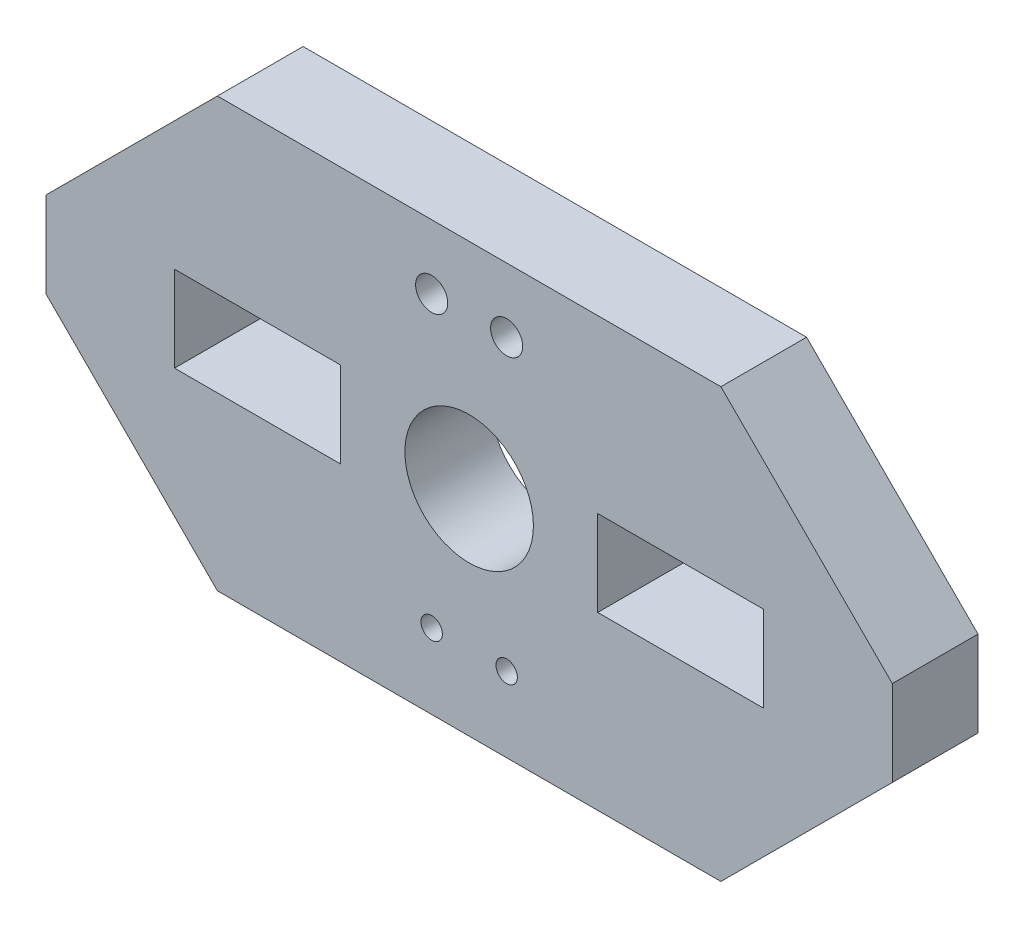
ISO-10303-21;
HEADER;
FILE_DESCRIPTION(('STEP AP214'),'2;1');
FILE_NAME('part.step','',(''),(''),'','','');
FILE_SCHEMA(('AUTOMOTIVE_DESIGN { 1 0 10303 214 1 1 1 1 }'));
ENDSEC;
DATA;
#1=APPLICATION_CONTEXT('core data for automotive mechanical design processes');
#2=APPLICATION_PROTOCOL_DEFINITION('international standard','automotive_design',2000,#1);
#3=PRODUCT_CONTEXT('',#1,'mechanical');
#4=PRODUCT('Part','Part','',(#3));
#5=PRODUCT_RELATED_PRODUCT_CATEGORY('part','',(#4));
#6=PRODUCT_DEFINITION_FORMATION('','',#4);
#7=PRODUCT_DEFINITION_CONTEXT('part definition',#1,'design');
#8=PRODUCT_DEFINITION('design','',#6,#7);
#9=PRODUCT_DEFINITION_SHAPE('','',#8);
#10=(LENGTH_UNIT() NAMED_UNIT(*) SI_UNIT(.MILLI.,.METRE.));
#11=(NAMED_UNIT(*) PLANE_ANGLE_UNIT() SI_UNIT($,.RADIAN.));
#12=(NAMED_UNIT(*) SI_UNIT($,.STERADIAN.) SOLID_ANGLE_UNIT());
#13=UNCERTAINTY_MEASURE_WITH_UNIT(LENGTH_MEASURE(1.E-05),#10,'distance_accuracy_value','');
#14=(GEOMETRIC_REPRESENTATION_CONTEXT(3) GLOBAL_UNCERTAINTY_ASSIGNED_CONTEXT((#13)) GLOBAL_UNIT_ASSIGNED_CONTEXT((#10,
#11,#12)) REPRESENTATION_CONTEXT('',''));
#15=CARTESIAN_POINT('',(0.,0.,0.));
#16=DIRECTION('',(0.,0.,1.));
#17=DIRECTION('',(1.,0.,0.));
#18=AXIS2_PLACEMENT_3D('',#15,#16,#17);
#19=CARTESIAN_POINT('',(-1.99999693325685,9.99999803628087,4.));
#20=DIRECTION('',(0.,0.,-1.));
#21=DIRECTION('',(-1.,0.,0.));
#22=AXIS2_PLACEMENT_3D('',#19,#20,#21);
#23=PLANE('',#22);
#24=CARTESIAN_POINT('',(18.0000030667433,3.49999803628092,4.));
#25=DIRECTION('',(0.,0.,1.));
#26=DIRECTION('',(1.,0.,0.));
#27=AXIS2_PLACEMENT_3D('',#24,#25,#26);
#28=CIRCLE('',#27,0.5);
#29=CARTESIAN_POINT('',(18.5000030667433,3.49999803628092,4.));
#30=VERTEX_POINT('',#29);
#31=EDGE_CURVE('E369',#30,#30,#28,.T.);
#32=ORIENTED_EDGE('',*,*,#31,.F.);
#33=EDGE_LOOP('',(#32));
#34=FACE_BOUND('',#33,.T.);
#35=CARTESIAN_POINT('',(18.0000030667433,16.9999980362809,4.));
#36=DIRECTION('',(0.,0.,1.));
#37=DIRECTION('',(1.,0.,0.));
#38=AXIS2_PLACEMENT_3D('',#35,#36,#37);
#39=CIRCLE('',#38,0.750000000000001);
#40=CARTESIAN_POINT('',(18.7500030667433,16.9999980362809,4.));
#41=VERTEX_POINT('',#40);
#42=EDGE_CURVE('E381',#41,#41,#39,.T.);
#43=ORIENTED_EDGE('',*,*,#42,.F.);
#44=EDGE_LOOP('',(#43));
#45=FACE_BOUND('',#44,.T.);
#46=DIRECTION('',(1.,0.,0.));
#47=VECTOR('',#46,1.);
#48=CARTESIAN_POINT('',(33.5000030667432,7.99999803628092,4.));
#49=LINE('',#48,#47);
#50=CARTESIAN_POINT('',(25.7500030667433,7.99999803628092,4.));
#51=VERTEX_POINT('',#50);
#52=CARTESIAN_POINT('',(33.5000030667432,7.99999803628092,4.));
#53=VERTEX_POINT('',#52);
#54=EDGE_CURVE('E145',#51,#53,#49,.T.);
#55=ORIENTED_EDGE('',*,*,#54,.F.);
#56=DIRECTION('',(0.,-1.,0.));
#57=VECTOR('',#56,1.);
#58=CARTESIAN_POINT('',(25.7500030667433,7.99999803628092,4.));
#59=LINE('',#58,#57);
#60=CARTESIAN_POINT('',(25.7500030667433,11.9999980362809,4.));
#61=VERTEX_POINT('',#60);
#62=EDGE_CURVE('E168',#61,#51,#59,.T.);
#63=ORIENTED_EDGE('',*,*,#62,.F.);
#64=DIRECTION('',(-1.,0.,0.));
#65=VECTOR('',#64,1.);
#66=CARTESIAN_POINT('',(25.7500030667433,11.9999980362809,4.));
#67=LINE('',#66,#65);
#68=CARTESIAN_POINT('',(33.5000030667432,11.9999980362809,4.));
#69=VERTEX_POINT('',#68);
#70=EDGE_CURVE('E166',#69,#61,#67,.T.);
#71=ORIENTED_EDGE('',*,*,#70,.F.);
#72=DIRECTION('',(0.,1.,0.));
#73=VECTOR('',#72,1.);
#74=CARTESIAN_POINT('',(33.5000030667432,11.9999980362809,4.));
#75=LINE('',#74,#73);
#76=EDGE_CURVE('E153',#53,#69,#75,.T.);
#77=ORIENTED_EDGE('',*,*,#76,.F.);
#78=EDGE_LOOP('',(#55,#63,#71,#77));
#79=FACE_BOUND('',#78,.T.);
#80=DIRECTION('',(-0.707106781186549,-0.707106781186546,0.));
#81=VECTOR('',#80,1.);
#82=CARTESIAN_POINT('',(8.00000306674323,19.9999980362809,4.));
#83=LINE('',#82,#81);
#84=CARTESIAN_POINT('',(8.00000306674323,19.9999980362809,4.));
#85=VERTEX_POINT('',#84);
#86=CARTESIAN_POINT('',(3.0667431972E-06,11.9999980362809,4.));
#87=VERTEX_POINT('',#86);
#88=EDGE_CURVE('E215',#85,#87,#83,.T.);
#89=ORIENTED_EDGE('',*,*,#88,.T.);
#90=DIRECTION('',(0.,-1.,0.));
#91=VECTOR('',#90,1.);
#92=CARTESIAN_POINT('',(3.066743254E-06,7.99999803628081,4.));
#93=LINE('',#92,#91);
#94=CARTESIAN_POINT('',(3.066743254E-06,7.99999803628081,4.));
#95=VERTEX_POINT('',#94);
#96=EDGE_CURVE('E218',#87,#95,#93,.T.);
#97=ORIENTED_EDGE('',*,*,#96,.T.);
#98=DIRECTION('',(0.707106781186556,-0.707106781186539,0.));
#99=VECTOR('',#98,1.);
#100=CARTESIAN_POINT('',(8.00000306674333,-1.9637190771E-06,4.));
#101=LINE('',#100,#99);
#102=CARTESIAN_POINT('',(8.00000306674333,-1.9637190771E-06,4.));
#103=VERTEX_POINT('',#102);
#104=EDGE_CURVE('E221',#95,#103,#101,.T.);
#105=ORIENTED_EDGE('',*,*,#104,.T.);
#106=DIRECTION('',(1.,0.,0.));
#107=VECTOR('',#106,1.);
#108=CARTESIAN_POINT('',(31.5000030667432,-1.963719078E-06,4.));
#109=LINE('',#108,#107);
#110=CARTESIAN_POINT('',(31.5000030667432,-1.963719078E-06,4.));
#111=VERTEX_POINT('',#110);
#112=EDGE_CURVE('E223',#103,#111,#109,.T.);
#113=ORIENTED_EDGE('',*,*,#112,.T.);
#114=DIRECTION('',(0.707106781186548,0.707106781186547,0.));
#115=VECTOR('',#114,1.);
#116=CARTESIAN_POINT('',(31.5000030667432,-1.963719078E-06,4.));
#117=LINE('',#116,#115);
#118=CARTESIAN_POINT('',(39.5000030667432,7.99999803628092,4.));
#119=VERTEX_POINT('',#118);
#120=EDGE_CURVE('E225',#111,#119,#117,.T.);
#121=ORIENTED_EDGE('',*,*,#120,.T.);
#122=DIRECTION('',(0.,1.,0.));
#123=VECTOR('',#122,1.);
#124=CARTESIAN_POINT('',(39.5000030667432,11.9999980362809,4.));
#125=LINE('',#124,#123);
#126=CARTESIAN_POINT('',(39.5000030667432,11.9999980362809,4.));
#127=VERTEX_POINT('',#126);
#128=EDGE_CURVE('E227',#119,#127,#125,.T.);
#129=ORIENTED_EDGE('',*,*,#128,.T.);
#130=DIRECTION('',(-0.707106781186548,0.707106781186547,0.));
#131=VECTOR('',#130,1.);
#132=CARTESIAN_POINT('',(39.5000030667432,11.9999980362809,4.));
#133=LINE('',#132,#131);
#134=CARTESIAN_POINT('',(31.5000030667432,19.9999980362809,4.));
#135=VERTEX_POINT('',#134);
#136=EDGE_CURVE('E229',#127,#135,#133,.T.);
#137=ORIENTED_EDGE('',*,*,#136,.T.);
#138=DIRECTION('',(-1.,0.,0.));
#139=VECTOR('',#138,1.);
#140=CARTESIAN_POINT('',(8.00000306674323,19.9999980362809,4.));
#141=LINE('',#140,#139);
#142=EDGE_CURVE('E231',#135,#85,#141,.T.);
#143=ORIENTED_EDGE('',*,*,#142,.T.);
#144=EDGE_LOOP('',(#89,#97,#105,#113,#121,#129,#137,#143));
#145=FACE_BOUND('',#144,.T.);
#146=DIRECTION('',(1.,0.,0.));
#147=VECTOR('',#146,1.);
#148=CARTESIAN_POINT('',(13.7500030667433,7.99999803628092,4.));
#149=LINE('',#148,#147);
#150=CARTESIAN_POINT('',(6.00000306674333,7.99999803628092,4.));
#151=VERTEX_POINT('',#150);
#152=CARTESIAN_POINT('',(13.7500030667433,7.99999803628092,4.));
#153=VERTEX_POINT('',#152);
#154=EDGE_CURVE('E184',#151,#153,#149,.T.);
#155=ORIENTED_EDGE('',*,*,#154,.F.);
#156=DIRECTION('',(0.,-1.,0.));
#157=VECTOR('',#156,1.);
#158=CARTESIAN_POINT('',(6.00000306674333,7.99999803628092,4.));
#159=LINE('',#158,#157);
#160=CARTESIAN_POINT('',(6.00000306674333,11.9999980362809,4.));
#161=VERTEX_POINT('',#160);
#162=EDGE_CURVE('E192',#161,#151,#159,.T.);
#163=ORIENTED_EDGE('',*,*,#162,.F.);
#164=DIRECTION('',(-1.,0.,0.));
#165=VECTOR('',#164,1.);
#166=CARTESIAN_POINT('',(6.00000306674333,11.9999980362809,4.));
#167=LINE('',#166,#165);
#168=CARTESIAN_POINT('',(13.7500030667433,11.9999980362809,4.));
#169=VERTEX_POINT('',#168);
#170=EDGE_CURVE('E189',#169,#161,#167,.T.);
#171=ORIENTED_EDGE('',*,*,#170,.F.);
#172=DIRECTION('',(0.,1.,0.));
#173=VECTOR('',#172,1.);
#174=CARTESIAN_POINT('',(13.7500030667433,11.9999980362809,4.));
#175=LINE('',#174,#173);
#176=EDGE_CURVE('E186',#153,#169,#175,.T.);
#177=ORIENTED_EDGE('',*,*,#176,.F.);
#178=EDGE_LOOP('',(#155,#163,#171,#177));
#179=FACE_BOUND('',#178,.T.);
#180=CARTESIAN_POINT('',(19.7500030667433,9.99999803628092,4.));
#181=DIRECTION('',(0.,0.,1.));
#182=DIRECTION('',(1.,0.,0.));
#183=AXIS2_PLACEMENT_3D('',#180,#181,#182);
#184=CIRCLE('',#183,3.);
#185=CARTESIAN_POINT('',(22.7500030667433,9.99999803628092,4.));
#186=VERTEX_POINT('',#185);
#187=EDGE_CURVE('E174',#186,#186,#184,.T.);
#188=ORIENTED_EDGE('',*,*,#187,.F.);
#189=EDGE_LOOP('',(#188));
#190=FACE_BOUND('',#189,.T.);
#191=CARTESIAN_POINT('',(21.5000030667433,16.9999980362809,4.));
#192=DIRECTION('',(0.,0.,1.));
#193=DIRECTION('',(1.,0.,0.));
#194=AXIS2_PLACEMENT_3D('',#191,#192,#193);
#195=CIRCLE('',#194,0.750000000000001);
#196=CARTESIAN_POINT('',(22.2500030667433,16.9999980362809,4.));
#197=VERTEX_POINT('',#196);
#198=EDGE_CURVE('E360',#197,#197,#195,.T.);
#199=ORIENTED_EDGE('',*,*,#198,.F.);
#200=EDGE_LOOP('',(#199));
#201=FACE_BOUND('',#200,.T.);
#202=CARTESIAN_POINT('',(21.5000030667433,3.49999803628092,4.));
#203=DIRECTION('',(0.,0.,1.));
#204=DIRECTION('',(1.,0.,0.));
#205=AXIS2_PLACEMENT_3D('',#202,#203,#204);
#206=CIRCLE('',#205,0.5);
#207=CARTESIAN_POINT('',(22.0000030667433,3.49999803628092,4.));
#208=VERTEX_POINT('',#207);
#209=EDGE_CURVE('E363',#208,#208,#206,.T.);
#210=ORIENTED_EDGE('',*,*,#209,.F.);
#211=EDGE_LOOP('',(#210));
#212=FACE_BOUND('',#211,.T.);
#213=ADVANCED_FACE('F32',(#34,#45,#79,#145,#179,#190,#201,#212),#23,.F.);
#214=CARTESIAN_POINT('',(-1.99999693325685,9.99999803628087,0.));
#215=DIRECTION('',(0.,0.,-1.));
#216=DIRECTION('',(-1.,0.,0.));
#217=AXIS2_PLACEMENT_3D('',#214,#215,#216);
#218=PLANE('',#217);
#219=CARTESIAN_POINT('',(18.0000030667433,3.49999803628092,0.));
#220=DIRECTION('',(0.,0.,1.));
#221=DIRECTION('',(1.,0.,0.));
#222=AXIS2_PLACEMENT_3D('',#219,#220,#221);
#223=CIRCLE('',#222,0.5);
#224=CARTESIAN_POINT('',(18.5000030667433,3.49999803628092,0.));
#225=VERTEX_POINT('',#224);
#226=EDGE_CURVE('E365',#225,#225,#223,.T.);
#227=ORIENTED_EDGE('',*,*,#226,.T.);
#228=EDGE_LOOP('',(#227));
#229=FACE_BOUND('',#228,.T.);
#230=CARTESIAN_POINT('',(18.0000030667433,16.9999980362809,0.));
#231=DIRECTION('',(0.,0.,1.));
#232=DIRECTION('',(1.,0.,0.));
#233=AXIS2_PLACEMENT_3D('',#230,#231,#232);
#234=CIRCLE('',#233,0.750000000000001);
#235=CARTESIAN_POINT('',(18.7500030667433,16.9999980362809,0.));
#236=VERTEX_POINT('',#235);
#237=EDGE_CURVE('E378',#236,#236,#234,.T.);
#238=ORIENTED_EDGE('',*,*,#237,.T.);
#239=EDGE_LOOP('',(#238));
#240=FACE_BOUND('',#239,.T.);
#241=DIRECTION('',(0.,-1.,0.));
#242=VECTOR('',#241,1.);
#243=CARTESIAN_POINT('',(25.7500030667433,7.99999803628092,0.));
#244=LINE('',#243,#242);
#245=CARTESIAN_POINT('',(25.7500030667433,11.9999980362809,0.));
#246=VERTEX_POINT('',#245);
#247=CARTESIAN_POINT('',(25.7500030667433,7.99999803628092,0.));
#248=VERTEX_POINT('',#247);
#249=EDGE_CURVE('E154',#246,#248,#244,.T.);
#250=ORIENTED_EDGE('',*,*,#249,.T.);
#251=DIRECTION('',(1.,0.,0.));
#252=VECTOR('',#251,1.);
#253=CARTESIAN_POINT('',(33.5000030667432,7.99999803628092,0.));
#254=LINE('',#253,#252);
#255=CARTESIAN_POINT('',(33.5000030667432,7.99999803628092,0.));
#256=VERTEX_POINT('',#255);
#257=EDGE_CURVE('E55',#248,#256,#254,.T.);
#258=ORIENTED_EDGE('',*,*,#257,.T.);
#259=DIRECTION('',(0.,1.,0.));
#260=VECTOR('',#259,1.);
#261=CARTESIAN_POINT('',(33.5000030667432,11.9999980362809,0.));
#262=LINE('',#261,#260);
#263=CARTESIAN_POINT('',(33.5000030667432,11.9999980362809,0.));
#264=VERTEX_POINT('',#263);
#265=EDGE_CURVE('E160',#256,#264,#262,.T.);
#266=ORIENTED_EDGE('',*,*,#265,.T.);
#267=DIRECTION('',(-1.,0.,0.));
#268=VECTOR('',#267,1.);
#269=CARTESIAN_POINT('',(25.7500030667433,11.9999980362809,0.));
#270=LINE('',#269,#268);
#271=EDGE_CURVE('E176',#264,#246,#270,.T.);
#272=ORIENTED_EDGE('',*,*,#271,.T.);
#273=EDGE_LOOP('',(#250,#258,#266,#272));
#274=FACE_BOUND('',#273,.T.);
#275=DIRECTION('',(-0.707106781186549,-0.707106781186546,0.));
#276=VECTOR('',#275,1.);
#277=CARTESIAN_POINT('',(8.00000306674323,19.9999980362809,0.));
#278=LINE('',#277,#276);
#279=CARTESIAN_POINT('',(8.00000306674323,19.9999980362809,0.));
#280=VERTEX_POINT('',#279);
#281=CARTESIAN_POINT('',(3.0667431972E-06,11.9999980362809,0.));
#282=VERTEX_POINT('',#281);
#283=EDGE_CURVE('E214',#280,#282,#278,.T.);
#284=ORIENTED_EDGE('',*,*,#283,.F.);
#285=DIRECTION('',(-1.,0.,0.));
#286=VECTOR('',#285,1.);
#287=CARTESIAN_POINT('',(8.00000306674323,19.9999980362809,0.));
#288=LINE('',#287,#286);
#289=CARTESIAN_POINT('',(31.5000030667432,19.9999980362809,0.));
#290=VERTEX_POINT('',#289);
#291=EDGE_CURVE('E219',#290,#280,#288,.T.);
#292=ORIENTED_EDGE('',*,*,#291,.F.);
#293=DIRECTION('',(-0.707106781186548,0.707106781186547,0.));
#294=VECTOR('',#293,1.);
#295=CARTESIAN_POINT('',(39.5000030667432,11.9999980362809,0.));
#296=LINE('',#295,#294);
#297=CARTESIAN_POINT('',(39.5000030667432,11.9999980362809,0.));
#298=VERTEX_POINT('',#297);
#299=EDGE_CURVE('E246',#298,#290,#296,.T.);
#300=ORIENTED_EDGE('',*,*,#299,.F.);
#301=DIRECTION('',(0.,1.,0.));
#302=VECTOR('',#301,1.);
#303=CARTESIAN_POINT('',(39.5000030667432,11.9999980362809,0.));
#304=LINE('',#303,#302);
#305=CARTESIAN_POINT('',(39.5000030667432,7.99999803628092,0.));
#306=VERTEX_POINT('',#305);
#307=EDGE_CURVE('E244',#306,#298,#304,.T.);
#308=ORIENTED_EDGE('',*,*,#307,.F.);
#309=DIRECTION('',(0.707106781186548,0.707106781186547,0.));
#310=VECTOR('',#309,1.);
#311=CARTESIAN_POINT('',(31.5000030667432,-1.963719078E-06,0.));
#312=LINE('',#311,#310);
#313=CARTESIAN_POINT('',(31.5000030667432,-1.963719078E-06,0.));
#314=VERTEX_POINT('',#313);
#315=EDGE_CURVE('E242',#314,#306,#312,.T.);
#316=ORIENTED_EDGE('',*,*,#315,.F.);
#317=DIRECTION('',(1.,0.,0.));
#318=VECTOR('',#317,1.);
#319=CARTESIAN_POINT('',(31.5000030667432,-1.963719078E-06,0.));
#320=LINE('',#319,#318);
#321=CARTESIAN_POINT('',(8.00000306674333,-1.9637190771E-06,0.));
#322=VERTEX_POINT('',#321);
#323=EDGE_CURVE('E240',#322,#314,#320,.T.);
#324=ORIENTED_EDGE('',*,*,#323,.F.);
#325=DIRECTION('',(0.707106781186556,-0.707106781186539,0.));
#326=VECTOR('',#325,1.);
#327=CARTESIAN_POINT('',(8.00000306674333,-1.9637190771E-06,0.));
#328=LINE('',#327,#326);
#329=CARTESIAN_POINT('',(3.066743254E-06,7.99999803628081,0.));
#330=VERTEX_POINT('',#329);
#331=EDGE_CURVE('E238',#330,#322,#328,.T.);
#332=ORIENTED_EDGE('',*,*,#331,.F.);
#333=DIRECTION('',(0.,-1.,0.));
#334=VECTOR('',#333,1.);
#335=CARTESIAN_POINT('',(3.066743254E-06,7.99999803628081,0.));
#336=LINE('',#335,#334);
#337=EDGE_CURVE('E236',#282,#330,#336,.T.);
#338=ORIENTED_EDGE('',*,*,#337,.F.);
#339=EDGE_LOOP('',(#284,#292,#300,#308,#316,#324,#332,#338));
#340=FACE_BOUND('',#339,.T.);
#341=DIRECTION('',(0.,-1.,0.));
#342=VECTOR('',#341,1.);
#343=CARTESIAN_POINT('',(6.00000306674333,7.99999803628092,0.));
#344=LINE('',#343,#342);
#345=CARTESIAN_POINT('',(6.00000306674333,11.9999980362809,0.));
#346=VERTEX_POINT('',#345);
#347=CARTESIAN_POINT('',(6.00000306674333,7.99999803628092,0.));
#348=VERTEX_POINT('',#347);
#349=EDGE_CURVE('E187',#346,#348,#344,.T.);
#350=ORIENTED_EDGE('',*,*,#349,.T.);
#351=DIRECTION('',(1.,0.,0.));
#352=VECTOR('',#351,1.);
#353=CARTESIAN_POINT('',(13.7500030667433,7.99999803628092,0.));
#354=LINE('',#353,#352);
#355=CARTESIAN_POINT('',(13.7500030667433,7.99999803628092,0.));
#356=VERTEX_POINT('',#355);
#357=EDGE_CURVE('E161',#348,#356,#354,.T.);
#358=ORIENTED_EDGE('',*,*,#357,.T.);
#359=DIRECTION('',(0.,1.,0.));
#360=VECTOR('',#359,1.);
#361=CARTESIAN_POINT('',(13.7500030667433,11.9999980362809,0.));
#362=LINE('',#361,#360);
#363=CARTESIAN_POINT('',(13.7500030667433,11.9999980362809,0.));
#364=VERTEX_POINT('',#363);
#365=EDGE_CURVE('E197',#356,#364,#362,.T.);
#366=ORIENTED_EDGE('',*,*,#365,.T.);
#367=DIRECTION('',(-1.,0.,0.));
#368=VECTOR('',#367,1.);
#369=CARTESIAN_POINT('',(6.00000306674333,11.9999980362809,0.));
#370=LINE('',#369,#368);
#371=EDGE_CURVE('E200',#364,#346,#370,.T.);
#372=ORIENTED_EDGE('',*,*,#371,.T.);
#373=EDGE_LOOP('',(#350,#358,#366,#372));
#374=FACE_BOUND('',#373,.T.);
#375=CARTESIAN_POINT('',(19.7500030667433,9.99999803628092,0.));
#376=DIRECTION('',(0.,0.,1.));
#377=DIRECTION('',(1.,0.,0.));
#378=AXIS2_PLACEMENT_3D('',#375,#376,#377);
#379=CIRCLE('',#378,3.);
#380=CARTESIAN_POINT('',(22.7500030667433,9.99999803628092,0.));
#381=VERTEX_POINT('',#380);
#382=EDGE_CURVE('E384',#381,#381,#379,.T.);
#383=ORIENTED_EDGE('',*,*,#382,.T.);
#384=EDGE_LOOP('',(#383));
#385=FACE_BOUND('',#384,.T.);
#386=CARTESIAN_POINT('',(21.5000030667433,16.9999980362809,0.));
#387=DIRECTION('',(0.,0.,1.));
#388=DIRECTION('',(1.,0.,0.));
#389=AXIS2_PLACEMENT_3D('',#386,#387,#388);
#390=CIRCLE('',#389,0.750000000000001);
#391=CARTESIAN_POINT('',(22.2500030667433,16.9999980362809,0.));
#392=VERTEX_POINT('',#391);
#393=EDGE_CURVE('E375',#392,#392,#390,.T.);
#394=ORIENTED_EDGE('',*,*,#393,.T.);
#395=EDGE_LOOP('',(#394));
#396=FACE_BOUND('',#395,.T.);
#397=CARTESIAN_POINT('',(21.5000030667433,3.49999803628092,0.));
#398=DIRECTION('',(0.,0.,1.));
#399=DIRECTION('',(1.,0.,0.));
#400=AXIS2_PLACEMENT_3D('',#397,#398,#399);
#401=CIRCLE('',#400,0.5);
#402=CARTESIAN_POINT('',(22.0000030667433,3.49999803628092,0.));
#403=VERTEX_POINT('',#402);
#404=EDGE_CURVE('E366',#403,#403,#401,.T.);
#405=ORIENTED_EDGE('',*,*,#404,.T.);
#406=EDGE_LOOP('',(#405));
#407=FACE_BOUND('',#406,.T.);
#408=ADVANCED_FACE('F276',(#229,#240,#274,#340,#374,#385,#396,#407),#218,.T.);
#409=CARTESIAN_POINT('',(8.00000306674323,19.9999980362809,4.));
#410=DIRECTION('',(0.707106781186546,-0.707106781186549,0.));
#411=DIRECTION('',(0.707106781186549,0.707106781186546,0.));
#412=AXIS2_PLACEMENT_3D('',#409,#410,#411);
#413=PLANE('',#412);
#414=ORIENTED_EDGE('',*,*,#283,.T.);
#415=DIRECTION('',(0.,0.,-1.));
#416=VECTOR('',#415,1.);
#417=CARTESIAN_POINT('',(3.0667431972E-06,11.9999980362809,4.));
#418=LINE('',#417,#416);
#419=EDGE_CURVE('E11',#87,#282,#418,.T.);
#420=ORIENTED_EDGE('',*,*,#419,.F.);
#421=ORIENTED_EDGE('',*,*,#88,.F.);
#422=DIRECTION('',(0.,0.,-1.));
#423=VECTOR('',#422,1.);
#424=CARTESIAN_POINT('',(8.00000306674323,19.9999980362809,4.));
#425=LINE('',#424,#423);
#426=EDGE_CURVE('E233',#85,#280,#425,.T.);
#427=ORIENTED_EDGE('',*,*,#426,.T.);
#428=EDGE_LOOP('',(#414,#420,#421,#427));
#429=FACE_BOUND('',#428,.T.);
#430=ADVANCED_FACE('F34',(#429),#413,.F.);
#431=CARTESIAN_POINT('',(3.066743254E-06,7.99999803628081,4.));
#432=DIRECTION('',(1.,0.,0.));
#433=DIRECTION('',(0.,1.,0.));
#434=AXIS2_PLACEMENT_3D('',#431,#432,#433);
#435=PLANE('',#434);
#436=ORIENTED_EDGE('',*,*,#337,.T.);
#437=DIRECTION('',(0.,0.,-1.));
#438=VECTOR('',#437,1.);
#439=CARTESIAN_POINT('',(3.066743254E-06,7.99999803628081,4.));
#440=LINE('',#439,#438);
#441=EDGE_CURVE('E40',#95,#330,#440,.T.);
#442=ORIENTED_EDGE('',*,*,#441,.F.);
#443=ORIENTED_EDGE('',*,*,#96,.F.);
#444=ORIENTED_EDGE('',*,*,#419,.T.);
#445=EDGE_LOOP('',(#436,#442,#443,#444));
#446=FACE_BOUND('',#445,.T.);
#447=ADVANCED_FACE('F293',(#446),#435,.F.);
#448=CARTESIAN_POINT('',(8.00000306674333,-1.9637190771E-06,4.));
#449=DIRECTION('',(0.707106781186539,0.707106781186556,0.));
#450=DIRECTION('',(-0.707106781186556,0.707106781186539,0.));
#451=AXIS2_PLACEMENT_3D('',#448,#449,#450);
#452=PLANE('',#451);
#453=ORIENTED_EDGE('',*,*,#331,.T.);
#454=DIRECTION('',(0.,0.,-1.));
#455=VECTOR('',#454,1.);
#456=CARTESIAN_POINT('',(8.00000306674333,-1.9637190771E-06,4.));
#457=LINE('',#456,#455);
#458=EDGE_CURVE('E263',#103,#322,#457,.T.);
#459=ORIENTED_EDGE('',*,*,#458,.F.);
#460=ORIENTED_EDGE('',*,*,#104,.F.);
#461=ORIENTED_EDGE('',*,*,#441,.T.);
#462=EDGE_LOOP('',(#453,#459,#460,#461));
#463=FACE_BOUND('',#462,.T.);
#464=ADVANCED_FACE('F270',(#463),#452,.F.);
#465=CARTESIAN_POINT('',(31.5000030667432,-1.963719078E-06,4.));
#466=DIRECTION('',(0.,1.,0.));
#467=DIRECTION('',(-1.,0.,0.));
#468=AXIS2_PLACEMENT_3D('',#465,#466,#467);
#469=PLANE('',#468);
#470=ORIENTED_EDGE('',*,*,#323,.T.);
#471=DIRECTION('',(0.,0.,-1.));
#472=VECTOR('',#471,1.);
#473=CARTESIAN_POINT('',(31.5000030667432,-1.963719078E-06,4.));
#474=LINE('',#473,#472);
#475=EDGE_CURVE('E260',#111,#314,#474,.T.);
#476=ORIENTED_EDGE('',*,*,#475,.F.);
#477=ORIENTED_EDGE('',*,*,#112,.F.);
#478=ORIENTED_EDGE('',*,*,#458,.T.);
#479=EDGE_LOOP('',(#470,#476,#477,#478));
#480=FACE_BOUND('',#479,.T.);
#481=ADVANCED_FACE('F282',(#480),#469,.F.);
#482=CARTESIAN_POINT('',(31.5000030667432,-1.963719078E-06,4.));
#483=DIRECTION('',(-0.707106781186547,0.707106781186548,0.));
#484=DIRECTION('',(-0.707106781186548,-0.707106781186547,0.));
#485=AXIS2_PLACEMENT_3D('',#482,#483,#484);
#486=PLANE('',#485);
#487=ORIENTED_EDGE('',*,*,#315,.T.);
#488=DIRECTION('',(0.,0.,-1.));
#489=VECTOR('',#488,1.);
#490=CARTESIAN_POINT('',(39.5000030667432,7.99999803628092,4.));
#491=LINE('',#490,#489);
#492=EDGE_CURVE('E257',#119,#306,#491,.T.);
#493=ORIENTED_EDGE('',*,*,#492,.F.);
#494=ORIENTED_EDGE('',*,*,#120,.F.);
#495=ORIENTED_EDGE('',*,*,#475,.T.);
#496=EDGE_LOOP('',(#487,#493,#494,#495));
#497=FACE_BOUND('',#496,.T.);
#498=ADVANCED_FACE('F286',(#497),#486,.F.);
#499=CARTESIAN_POINT('',(39.5000030667432,11.9999980362809,4.));
#500=DIRECTION('',(-1.,0.,0.));
#501=DIRECTION('',(0.,0.,1.));
#502=AXIS2_PLACEMENT_3D('',#499,#500,#501);
#503=PLANE('',#502);
#504=ORIENTED_EDGE('',*,*,#307,.T.);
#505=DIRECTION('',(0.,0.,-1.));
#506=VECTOR('',#505,1.);
#507=CARTESIAN_POINT('',(39.5000030667432,11.9999980362809,4.));
#508=LINE('',#507,#506);
#509=EDGE_CURVE('E254',#127,#298,#508,.T.);
#510=ORIENTED_EDGE('',*,*,#509,.F.);
#511=ORIENTED_EDGE('',*,*,#128,.F.);
#512=ORIENTED_EDGE('',*,*,#492,.T.);
#513=EDGE_LOOP('',(#504,#510,#511,#512));
#514=FACE_BOUND('',#513,.T.);
#515=ADVANCED_FACE('F306',(#514),#503,.F.);
#516=CARTESIAN_POINT('',(39.5000030667432,11.9999980362809,4.));
#517=DIRECTION('',(-0.707106781186547,-0.707106781186548,0.));
#518=DIRECTION('',(0.707106781186548,-0.707106781186547,0.));
#519=AXIS2_PLACEMENT_3D('',#516,#517,#518);
#520=PLANE('',#519);
#521=ORIENTED_EDGE('',*,*,#299,.T.);
#522=DIRECTION('',(0.,0.,-1.));
#523=VECTOR('',#522,1.);
#524=CARTESIAN_POINT('',(31.5000030667432,19.9999980362809,4.));
#525=LINE('',#524,#523);
#526=EDGE_CURVE('E251',#135,#290,#525,.T.);
#527=ORIENTED_EDGE('',*,*,#526,.F.);
#528=ORIENTED_EDGE('',*,*,#136,.F.);
#529=ORIENTED_EDGE('',*,*,#509,.T.);
#530=EDGE_LOOP('',(#521,#527,#528,#529));
#531=FACE_BOUND('',#530,.T.);
#532=ADVANCED_FACE('F304',(#531),#520,.F.);
#533=CARTESIAN_POINT('',(8.00000306674323,19.9999980362809,4.));
#534=DIRECTION('',(0.,-1.,0.));
#535=DIRECTION('',(0.,0.,-1.));
#536=AXIS2_PLACEMENT_3D('',#533,#534,#535);
#537=PLANE('',#536);
#538=ORIENTED_EDGE('',*,*,#291,.T.);
#539=ORIENTED_EDGE('',*,*,#426,.F.);
#540=ORIENTED_EDGE('',*,*,#142,.F.);
#541=ORIENTED_EDGE('',*,*,#526,.T.);
#542=EDGE_LOOP('',(#538,#539,#540,#541));
#543=FACE_BOUND('',#542,.T.);
#544=ADVANCED_FACE('F299',(#543),#537,.F.);
#545=CARTESIAN_POINT('',(13.7500030667433,7.99999803628092,4.));
#546=DIRECTION('',(0.,1.,0.));
#547=DIRECTION('',(0.,0.,1.));
#548=AXIS2_PLACEMENT_3D('',#545,#546,#547);
#549=PLANE('',#548);
#550=ORIENTED_EDGE('',*,*,#357,.F.);
#551=DIRECTION('',(0.,0.,-1.));
#552=VECTOR('',#551,1.);
#553=CARTESIAN_POINT('',(6.00000306674333,7.99999803628092,4.));
#554=LINE('',#553,#552);
#555=EDGE_CURVE('E194',#151,#348,#554,.T.);
#556=ORIENTED_EDGE('',*,*,#555,.F.);
#557=ORIENTED_EDGE('',*,*,#154,.T.);
#558=DIRECTION('',(0.,0.,-1.));
#559=VECTOR('',#558,1.);
#560=CARTESIAN_POINT('',(13.7500030667433,7.99999803628092,4.));
#561=LINE('',#560,#559);
#562=EDGE_CURVE('E211',#153,#356,#561,.T.);
#563=ORIENTED_EDGE('',*,*,#562,.T.);
#564=EDGE_LOOP('',(#550,#556,#557,#563));
#565=FACE_BOUND('',#564,.T.);
#566=ADVANCED_FACE('F326',(#565),#549,.T.);
#567=CARTESIAN_POINT('',(13.7500030667433,11.9999980362809,4.));
#568=DIRECTION('',(-1.,0.,0.));
#569=DIRECTION('',(0.,0.,1.));
#570=AXIS2_PLACEMENT_3D('',#567,#568,#569);
#571=PLANE('',#570);
#572=ORIENTED_EDGE('',*,*,#365,.F.);
#573=ORIENTED_EDGE('',*,*,#562,.F.);
#574=ORIENTED_EDGE('',*,*,#176,.T.);
#575=DIRECTION('',(0.,0.,-1.));
#576=VECTOR('',#575,1.);
#577=CARTESIAN_POINT('',(13.7500030667433,11.9999980362809,4.));
#578=LINE('',#577,#576);
#579=EDGE_CURVE('E209',#169,#364,#578,.T.);
#580=ORIENTED_EDGE('',*,*,#579,.T.);
#581=EDGE_LOOP('',(#572,#573,#574,#580));
#582=FACE_BOUND('',#581,.T.);
#583=ADVANCED_FACE('F333',(#582),#571,.T.);
#584=CARTESIAN_POINT('',(6.00000306674333,11.9999980362809,4.));
#585=DIRECTION('',(0.,-1.,0.));
#586=DIRECTION('',(0.,0.,-1.));
#587=AXIS2_PLACEMENT_3D('',#584,#585,#586);
#588=PLANE('',#587);
#589=ORIENTED_EDGE('',*,*,#371,.F.);
#590=ORIENTED_EDGE('',*,*,#579,.F.);
#591=ORIENTED_EDGE('',*,*,#170,.T.);
#592=DIRECTION('',(0.,0.,-1.));
#593=VECTOR('',#592,1.);
#594=CARTESIAN_POINT('',(6.00000306674333,11.9999980362809,4.));
#595=LINE('',#594,#593);
#596=EDGE_CURVE('E207',#161,#346,#595,.T.);
#597=ORIENTED_EDGE('',*,*,#596,.T.);
#598=EDGE_LOOP('',(#589,#590,#591,#597));
#599=FACE_BOUND('',#598,.T.);
#600=ADVANCED_FACE('F338',(#599),#588,.T.);
#601=CARTESIAN_POINT('',(6.00000306674333,7.99999803628092,4.));
#602=DIRECTION('',(1.,0.,0.));
#603=DIRECTION('',(0.,0.,-1.));
#604=AXIS2_PLACEMENT_3D('',#601,#602,#603);
#605=PLANE('',#604);
#606=ORIENTED_EDGE('',*,*,#349,.F.);
#607=ORIENTED_EDGE('',*,*,#596,.F.);
#608=ORIENTED_EDGE('',*,*,#162,.T.);
#609=ORIENTED_EDGE('',*,*,#555,.T.);
#610=EDGE_LOOP('',(#606,#607,#608,#609));
#611=FACE_BOUND('',#610,.T.);
#612=ADVANCED_FACE('F345',(#611),#605,.T.);
#613=CARTESIAN_POINT('',(33.5000030667432,7.99999803628092,4.));
#614=DIRECTION('',(0.,1.,0.));
#615=DIRECTION('',(0.,0.,1.));
#616=AXIS2_PLACEMENT_3D('',#613,#614,#615);
#617=PLANE('',#616);
#618=ORIENTED_EDGE('',*,*,#257,.F.);
#619=DIRECTION('',(0.,0.,-1.));
#620=VECTOR('',#619,1.);
#621=CARTESIAN_POINT('',(25.7500030667433,7.99999803628092,4.));
#622=LINE('',#621,#620);
#623=EDGE_CURVE('E149',#51,#248,#622,.T.);
#624=ORIENTED_EDGE('',*,*,#623,.F.);
#625=ORIENTED_EDGE('',*,*,#54,.T.);
#626=DIRECTION('',(0.,0.,-1.));
#627=VECTOR('',#626,1.);
#628=CARTESIAN_POINT('',(33.5000030667432,7.99999803628092,4.));
#629=LINE('',#628,#627);
#630=EDGE_CURVE('E148',#53,#256,#629,.T.);
#631=ORIENTED_EDGE('',*,*,#630,.T.);
#632=EDGE_LOOP('',(#618,#624,#625,#631));
#633=FACE_BOUND('',#632,.T.);
#634=ADVANCED_FACE('F147',(#633),#617,.T.);
#635=CARTESIAN_POINT('',(33.5000030667432,11.9999980362809,4.));
#636=DIRECTION('',(-1.,0.,0.));
#637=DIRECTION('',(0.,0.,1.));
#638=AXIS2_PLACEMENT_3D('',#635,#636,#637);
#639=PLANE('',#638);
#640=ORIENTED_EDGE('',*,*,#265,.F.);
#641=ORIENTED_EDGE('',*,*,#630,.F.);
#642=ORIENTED_EDGE('',*,*,#76,.T.);
#643=DIRECTION('',(0.,0.,-1.));
#644=VECTOR('',#643,1.);
#645=CARTESIAN_POINT('',(33.5000030667432,11.9999980362809,4.));
#646=LINE('',#645,#644);
#647=EDGE_CURVE('E162',#69,#264,#646,.T.);
#648=ORIENTED_EDGE('',*,*,#647,.T.);
#649=EDGE_LOOP('',(#640,#641,#642,#648));
#650=FACE_BOUND('',#649,.T.);
#651=ADVANCED_FACE('F157',(#650),#639,.T.);
#652=CARTESIAN_POINT('',(25.7500030667433,11.9999980362809,4.));
#653=DIRECTION('',(0.,-1.,0.));
#654=DIRECTION('',(0.,0.,-1.));
#655=AXIS2_PLACEMENT_3D('',#652,#653,#654);
#656=PLANE('',#655);
#657=ORIENTED_EDGE('',*,*,#271,.F.);
#658=ORIENTED_EDGE('',*,*,#647,.F.);
#659=ORIENTED_EDGE('',*,*,#70,.T.);
#660=DIRECTION('',(0.,0.,-1.));
#661=VECTOR('',#660,1.);
#662=CARTESIAN_POINT('',(25.7500030667433,11.9999980362809,4.));
#663=LINE('',#662,#661);
#664=EDGE_CURVE('E47',#61,#246,#663,.T.);
#665=ORIENTED_EDGE('',*,*,#664,.T.);
#666=EDGE_LOOP('',(#657,#658,#659,#665));
#667=FACE_BOUND('',#666,.T.);
#668=ADVANCED_FACE('F404',(#667),#656,.T.);
#669=CARTESIAN_POINT('',(25.7500030667433,7.99999803628092,4.));
#670=DIRECTION('',(1.,0.,0.));
#671=DIRECTION('',(0.,0.,-1.));
#672=AXIS2_PLACEMENT_3D('',#669,#670,#671);
#673=PLANE('',#672);
#674=ORIENTED_EDGE('',*,*,#249,.F.);
#675=ORIENTED_EDGE('',*,*,#664,.F.);
#676=ORIENTED_EDGE('',*,*,#62,.T.);
#677=ORIENTED_EDGE('',*,*,#623,.T.);
#678=EDGE_LOOP('',(#674,#675,#676,#677));
#679=FACE_BOUND('',#678,.T.);
#680=ADVANCED_FACE('F394',(#679),#673,.T.);
#681=CARTESIAN_POINT('',(19.7500030667433,9.99999803628092,4.));
#682=DIRECTION('',(0.,0.,-1.));
#683=DIRECTION('',(-1.,0.,0.));
#684=AXIS2_PLACEMENT_3D('',#681,#682,#683);
#685=CYLINDRICAL_SURFACE('',#684,3.);
#686=ORIENTED_EDGE('',*,*,#187,.T.);
#687=EDGE_LOOP('',(#686));
#688=FACE_BOUND('',#687,.T.);
#689=ORIENTED_EDGE('',*,*,#382,.F.);
#690=EDGE_LOOP('',(#689));
#691=FACE_BOUND('',#690,.T.);
#692=ADVANCED_FACE('F391',(#688,#691),#685,.F.);
#693=CARTESIAN_POINT('',(18.0000030667433,16.9999980362809,4.));
#694=DIRECTION('',(0.,0.,-1.));
#695=DIRECTION('',(-1.,0.,0.));
#696=AXIS2_PLACEMENT_3D('',#693,#694,#695);
#697=CYLINDRICAL_SURFACE('',#696,0.750000000000001);
#698=ORIENTED_EDGE('',*,*,#42,.T.);
#699=EDGE_LOOP('',(#698));
#700=FACE_BOUND('',#699,.T.);
#701=ORIENTED_EDGE('',*,*,#237,.F.);
#702=EDGE_LOOP('',(#701));
#703=FACE_BOUND('',#702,.T.);
#704=ADVANCED_FACE('F393',(#700,#703),#697,.F.);
#705=CARTESIAN_POINT('',(21.5000030667433,16.9999980362809,4.));
#706=DIRECTION('',(0.,0.,-1.));
#707=DIRECTION('',(-1.,0.,0.));
#708=AXIS2_PLACEMENT_3D('',#705,#706,#707);
#709=CYLINDRICAL_SURFACE('',#708,0.750000000000001);
#710=ORIENTED_EDGE('',*,*,#198,.T.);
#711=EDGE_LOOP('',(#710));
#712=FACE_BOUND('',#711,.T.);
#713=ORIENTED_EDGE('',*,*,#393,.F.);
#714=EDGE_LOOP('',(#713));
#715=FACE_BOUND('',#714,.T.);
#716=ADVANCED_FACE('F401',(#712,#715),#709,.F.);
#717=CARTESIAN_POINT('',(18.0000030667433,3.49999803628092,4.));
#718=DIRECTION('',(0.,0.,-1.));
#719=DIRECTION('',(-1.,0.,0.));
#720=AXIS2_PLACEMENT_3D('',#717,#718,#719);
#721=CYLINDRICAL_SURFACE('',#720,0.5);
#722=ORIENTED_EDGE('',*,*,#31,.T.);
#723=EDGE_LOOP('',(#722));
#724=FACE_BOUND('',#723,.T.);
#725=ORIENTED_EDGE('',*,*,#226,.F.);
#726=EDGE_LOOP('',(#725));
#727=FACE_BOUND('',#726,.T.);
#728=ADVANCED_FACE('F461',(#724,#727),#721,.F.);
#729=CARTESIAN_POINT('',(21.5000030667433,3.49999803628092,4.));
#730=DIRECTION('',(0.,0.,-1.));
#731=DIRECTION('',(-1.,0.,0.));
#732=AXIS2_PLACEMENT_3D('',#729,#730,#731);
#733=CYLINDRICAL_SURFACE('',#732,0.5);
#734=ORIENTED_EDGE('',*,*,#209,.T.);
#735=EDGE_LOOP('',(#734));
#736=FACE_BOUND('',#735,.T.);
#737=ORIENTED_EDGE('',*,*,#404,.F.);
#738=EDGE_LOOP('',(#737));
#739=FACE_BOUND('',#738,.T.);
#740=ADVANCED_FACE('F470',(#736,#739),#733,.F.);
#741=CLOSED_SHELL('',(#213,#408,#430,#447,#464,#481,#498,#515,#532,#544,#566,#583,#600,#612,
#634,#651,#668,#680,#692,#704,#716,#728,#740));
#742=MANIFOLD_SOLID_BREP('B2',#741);
#743=ADVANCED_BREP_SHAPE_REPRESENTATION('',(#18,#742),#14);
#744=SHAPE_DEFINITION_REPRESENTATION(#9,#743);
ENDSEC;
END-ISO-10303-21;
